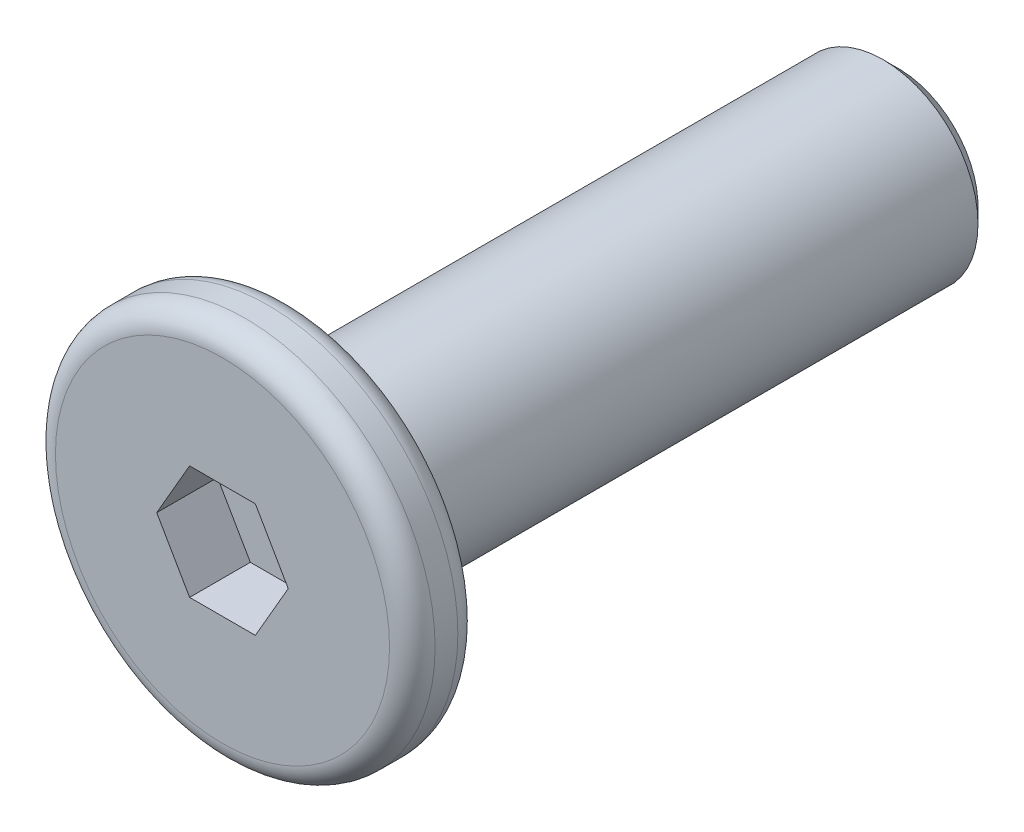
ISO-10303-21;
HEADER;
FILE_DESCRIPTION(('STEP AP214'),'2;1');
FILE_NAME('part.step','',(''),(''),'','','');
FILE_SCHEMA(('AUTOMOTIVE_DESIGN { 1 0 10303 214 1 1 1 1 }'));
ENDSEC;
DATA;
#1=APPLICATION_CONTEXT('core data for automotive mechanical design processes');
#2=APPLICATION_PROTOCOL_DEFINITION('international standard','automotive_design',2000,#1);
#3=PRODUCT_CONTEXT('',#1,'mechanical');
#4=PRODUCT('Part','Part','',(#3));
#5=PRODUCT_RELATED_PRODUCT_CATEGORY('part','',(#4));
#6=PRODUCT_DEFINITION_FORMATION('','',#4);
#7=PRODUCT_DEFINITION_CONTEXT('part definition',#1,'design');
#8=PRODUCT_DEFINITION('design','',#6,#7);
#9=PRODUCT_DEFINITION_SHAPE('','',#8);
#10=(LENGTH_UNIT() NAMED_UNIT(*) SI_UNIT(.MILLI.,.METRE.));
#11=(NAMED_UNIT(*) PLANE_ANGLE_UNIT() SI_UNIT($,.RADIAN.));
#12=(NAMED_UNIT(*) SI_UNIT($,.STERADIAN.) SOLID_ANGLE_UNIT());
#13=UNCERTAINTY_MEASURE_WITH_UNIT(LENGTH_MEASURE(1.E-05),#10,'distance_accuracy_value','');
#14=(GEOMETRIC_REPRESENTATION_CONTEXT(3) GLOBAL_UNCERTAINTY_ASSIGNED_CONTEXT((#13)) GLOBAL_UNIT_ASSIGNED_CONTEXT((#10,
#11,#12)) REPRESENTATION_CONTEXT('',''));
#15=CARTESIAN_POINT('',(0.,0.,0.));
#16=DIRECTION('',(0.,0.,1.));
#17=DIRECTION('',(1.,0.,0.));
#18=AXIS2_PLACEMENT_3D('',#15,#16,#17);
#19=CARTESIAN_POINT('',(0.,0.,0.45));
#20=DIRECTION('',(0.,0.,-1.));
#21=DIRECTION('',(-1.,0.,0.));
#22=AXIS2_PLACEMENT_3D('',#19,#20,#21);
#23=CYLINDRICAL_SURFACE('',#22,2.5);
#24=CARTESIAN_POINT('',(0.,0.,-0.15));
#25=DIRECTION('',(0.,0.,1.));
#26=DIRECTION('',(1.,0.,0.));
#27=AXIS2_PLACEMENT_3D('',#24,#25,#26);
#28=CIRCLE('',#27,2.5);
#29=CARTESIAN_POINT('',(2.5,0.,-0.15));
#30=VERTEX_POINT('',#29);
#31=EDGE_CURVE('E154',#30,#30,#28,.T.);
#32=ORIENTED_EDGE('',*,*,#31,.T.);
#33=EDGE_LOOP('',(#32));
#34=FACE_BOUND('',#33,.T.);
#35=CARTESIAN_POINT('',(0.,0.,0.15));
#36=DIRECTION('',(0.,0.,1.));
#37=DIRECTION('',(1.,0.,0.));
#38=AXIS2_PLACEMENT_3D('',#35,#36,#37);
#39=CIRCLE('',#38,2.5);
#40=CARTESIAN_POINT('',(2.5,0.,0.15));
#41=VERTEX_POINT('',#40);
#42=EDGE_CURVE('E151',#41,#41,#39,.F.);
#43=ORIENTED_EDGE('',*,*,#42,.T.);
#44=EDGE_LOOP('',(#43));
#45=FACE_BOUND('',#44,.T.);
#46=ADVANCED_FACE('F35',(#34,#45),#23,.T.);
#47=CARTESIAN_POINT('',(0.,0.,0.45));
#48=DIRECTION('',(0.,0.,1.));
#49=DIRECTION('',(1.,0.,0.));
#50=AXIS2_PLACEMENT_3D('',#47,#48,#49);
#51=PLANE('',#50);
#52=CARTESIAN_POINT('',(0.,0.,0.45));
#53=DIRECTION('',(0.,0.,1.));
#54=DIRECTION('',(1.,0.,0.));
#55=AXIS2_PLACEMENT_3D('',#52,#53,#54);
#56=CIRCLE('',#55,2.2);
#57=CARTESIAN_POINT('',(2.2,0.,0.45));
#58=VERTEX_POINT('',#57);
#59=EDGE_CURVE('E11',#58,#58,#56,.T.);
#60=ORIENTED_EDGE('',*,*,#59,.T.);
#61=EDGE_LOOP('',(#60));
#62=FACE_BOUND('',#61,.T.);
#63=DIRECTION('',(0.5,0.866025403784439,0.));
#64=VECTOR('',#63,1.);
#65=CARTESIAN_POINT('',(0.433012701892219,-0.75,0.45));
#66=LINE('',#65,#64);
#67=CARTESIAN_POINT('',(0.433012701892219,-0.75,0.45));
#68=VERTEX_POINT('',#67);
#69=CARTESIAN_POINT('',(0.866025403784439,0.,0.45));
#70=VERTEX_POINT('',#69);
#71=EDGE_CURVE('E50',#68,#70,#66,.T.);
#72=ORIENTED_EDGE('',*,*,#71,.F.);
#73=DIRECTION('',(1.,0.,0.));
#74=VECTOR('',#73,1.);
#75=CARTESIAN_POINT('',(-0.433012701892219,-0.75,0.45));
#76=LINE('',#75,#74);
#77=CARTESIAN_POINT('',(-0.433012701892219,-0.75,0.45));
#78=VERTEX_POINT('',#77);
#79=EDGE_CURVE('E133',#78,#68,#76,.T.);
#80=ORIENTED_EDGE('',*,*,#79,.F.);
#81=DIRECTION('',(0.500000000000001,-0.866025403784438,0.));
#82=VECTOR('',#81,1.);
#83=CARTESIAN_POINT('',(-0.866025403784439,0.,0.45));
#84=LINE('',#83,#82);
#85=CARTESIAN_POINT('',(-0.866025403784439,0.,0.45));
#86=VERTEX_POINT('',#85);
#87=EDGE_CURVE('E131',#86,#78,#84,.T.);
#88=ORIENTED_EDGE('',*,*,#87,.F.);
#89=DIRECTION('',(-0.5,-0.866025403784438,0.));
#90=VECTOR('',#89,1.);
#91=CARTESIAN_POINT('',(-0.433012701892219,0.75,0.45));
#92=LINE('',#91,#90);
#93=CARTESIAN_POINT('',(-0.433012701892219,0.75,0.45));
#94=VERTEX_POINT('',#93);
#95=EDGE_CURVE('E98',#94,#86,#92,.T.);
#96=ORIENTED_EDGE('',*,*,#95,.F.);
#97=DIRECTION('',(-1.,0.,0.));
#98=VECTOR('',#97,1.);
#99=CARTESIAN_POINT('',(0.433012701892219,0.75,0.45));
#100=LINE('',#99,#98);
#101=CARTESIAN_POINT('',(0.433012701892219,0.75,0.45));
#102=VERTEX_POINT('',#101);
#103=EDGE_CURVE('E127',#102,#94,#100,.T.);
#104=ORIENTED_EDGE('',*,*,#103,.F.);
#105=DIRECTION('',(-0.5,0.866025403784438,0.));
#106=VECTOR('',#105,1.);
#107=CARTESIAN_POINT('',(0.866025403784439,0.,0.45));
#108=LINE('',#107,#106);
#109=EDGE_CURVE('E124',#70,#102,#108,.T.);
#110=ORIENTED_EDGE('',*,*,#109,.F.);
#111=EDGE_LOOP('',(#72,#80,#88,#96,#104,#110));
#112=FACE_BOUND('',#111,.T.);
#113=ADVANCED_FACE('F169',(#62,#112),#51,.T.);
#114=CARTESIAN_POINT('',(0.,0.,-0.45));
#115=DIRECTION('',(0.,0.,1.));
#116=DIRECTION('',(1.,0.,0.));
#117=AXIS2_PLACEMENT_3D('',#114,#115,#116);
#118=PLANE('',#117);
#119=CARTESIAN_POINT('',(0.,0.,-0.45));
#120=DIRECTION('',(0.,0.,1.));
#121=DIRECTION('',(1.,0.,0.));
#122=AXIS2_PLACEMENT_3D('',#119,#120,#121);
#123=CIRCLE('',#122,2.2);
#124=CARTESIAN_POINT('',(2.2,0.,-0.45));
#125=VERTEX_POINT('',#124);
#126=EDGE_CURVE('E43',#125,#125,#123,.F.);
#127=ORIENTED_EDGE('',*,*,#126,.T.);
#128=EDGE_LOOP('',(#127));
#129=FACE_BOUND('',#128,.T.);
#130=CARTESIAN_POINT('',(0.,0.,-0.45));
#131=DIRECTION('',(0.,0.,-1.));
#132=DIRECTION('',(-1.,0.,0.));
#133=AXIS2_PLACEMENT_3D('',#130,#131,#132);
#134=CIRCLE('',#133,1.25);
#135=CARTESIAN_POINT('',(-1.25,0.,-0.45));
#136=VERTEX_POINT('',#135);
#137=EDGE_CURVE('E137',#136,#136,#134,.T.);
#138=ORIENTED_EDGE('',*,*,#137,.F.);
#139=EDGE_LOOP('',(#138));
#140=FACE_BOUND('',#139,.T.);
#141=ADVANCED_FACE('F159',(#129,#140),#118,.F.);
#142=CARTESIAN_POINT('',(0.,0.,-8.45));
#143=DIRECTION('',(0.,0.,1.));
#144=DIRECTION('',(1.,0.,0.));
#145=AXIS2_PLACEMENT_3D('',#142,#143,#144);
#146=CYLINDRICAL_SURFACE('',#145,1.25);
#147=CARTESIAN_POINT('',(0.,0.,-8.25));
#148=DIRECTION('',(0.,0.,-1.));
#149=DIRECTION('',(-1.,0.,0.));
#150=AXIS2_PLACEMENT_3D('',#147,#148,#149);
#151=CIRCLE('',#150,1.25);
#152=CARTESIAN_POINT('',(-1.25,0.,-8.25));
#153=VERTEX_POINT('',#152);
#154=EDGE_CURVE('E148',#153,#153,#151,.F.);
#155=ORIENTED_EDGE('',*,*,#154,.T.);
#156=EDGE_LOOP('',(#155));
#157=FACE_BOUND('',#156,.T.);
#158=ORIENTED_EDGE('',*,*,#137,.T.);
#159=EDGE_LOOP('',(#158));
#160=FACE_BOUND('',#159,.T.);
#161=ADVANCED_FACE('F204',(#157,#160),#146,.T.);
#162=CARTESIAN_POINT('',(0.,0.,-8.45));
#163=DIRECTION('',(0.,0.,-1.));
#164=DIRECTION('',(-1.,0.,0.));
#165=AXIS2_PLACEMENT_3D('',#162,#163,#164);
#166=PLANE('',#165);
#167=CARTESIAN_POINT('',(0.,0.,-8.45));
#168=DIRECTION('',(0.,0.,-1.));
#169=DIRECTION('',(-1.,0.,0.));
#170=AXIS2_PLACEMENT_3D('',#167,#168,#169);
#171=CIRCLE('',#170,1.05);
#172=CARTESIAN_POINT('',(-1.05,0.,-8.45));
#173=VERTEX_POINT('',#172);
#174=EDGE_CURVE('E145',#173,#173,#171,.T.);
#175=ORIENTED_EDGE('',*,*,#174,.T.);
#176=EDGE_LOOP('',(#175));
#177=FACE_BOUND('',#176,.T.);
#178=ADVANCED_FACE('F196',(#177),#166,.T.);
#179=CARTESIAN_POINT('',(0.,0.,-8.45));
#180=DIRECTION('',(0.,0.,1.));
#181=DIRECTION('',(1.,0.,0.));
#182=AXIS2_PLACEMENT_3D('',#179,#180,#181);
#183=CONICAL_SURFACE('',#182,1.05,0.785398163397446);
#184=ORIENTED_EDGE('',*,*,#154,.F.);
#185=EDGE_LOOP('',(#184));
#186=FACE_BOUND('',#185,.T.);
#187=ORIENTED_EDGE('',*,*,#174,.F.);
#188=EDGE_LOOP('',(#187));
#189=FACE_BOUND('',#188,.T.);
#190=ADVANCED_FACE('F189',(#186,#189),#183,.T.);
#191=CARTESIAN_POINT('',(0.433012701892219,-0.75,-0.35));
#192=DIRECTION('',(0.866025403784439,-0.5,0.));
#193=DIRECTION('',(0.5,0.866025403784439,0.));
#194=AXIS2_PLACEMENT_3D('',#191,#192,#193);
#195=PLANE('',#194);
#196=ORIENTED_EDGE('',*,*,#71,.T.);
#197=DIRECTION('',(0.,0.,1.));
#198=VECTOR('',#197,1.);
#199=CARTESIAN_POINT('',(0.866025403784439,0.,-0.35));
#200=LINE('',#199,#198);
#201=CARTESIAN_POINT('',(0.866025403784439,0.,-0.35));
#202=VERTEX_POINT('',#201);
#203=EDGE_CURVE('E80',#202,#70,#200,.T.);
#204=ORIENTED_EDGE('',*,*,#203,.F.);
#205=DIRECTION('',(0.5,0.866025403784439,0.));
#206=VECTOR('',#205,1.);
#207=CARTESIAN_POINT('',(0.433012701892219,-0.75,-0.35));
#208=LINE('',#207,#206);
#209=CARTESIAN_POINT('',(0.433012701892219,-0.75,-0.35));
#210=VERTEX_POINT('',#209);
#211=EDGE_CURVE('E135',#210,#202,#208,.T.);
#212=ORIENTED_EDGE('',*,*,#211,.F.);
#213=DIRECTION('',(0.,0.,1.));
#214=VECTOR('',#213,1.);
#215=CARTESIAN_POINT('',(0.433012701892219,-0.75,-0.35));
#216=LINE('',#215,#214);
#217=EDGE_CURVE('E58',#210,#68,#216,.T.);
#218=ORIENTED_EDGE('',*,*,#217,.T.);
#219=EDGE_LOOP('',(#196,#204,#212,#218));
#220=FACE_BOUND('',#219,.T.);
#221=ADVANCED_FACE('F186',(#220),#195,.F.);
#222=CARTESIAN_POINT('',(-0.433012701892219,-0.75,-0.35));
#223=DIRECTION('',(0.,-1.,0.));
#224=DIRECTION('',(0.,0.,-1.));
#225=AXIS2_PLACEMENT_3D('',#222,#223,#224);
#226=PLANE('',#225);
#227=ORIENTED_EDGE('',*,*,#79,.T.);
#228=ORIENTED_EDGE('',*,*,#217,.F.);
#229=DIRECTION('',(1.,0.,0.));
#230=VECTOR('',#229,1.);
#231=CARTESIAN_POINT('',(-0.433012701892219,-0.75,-0.35));
#232=LINE('',#231,#230);
#233=CARTESIAN_POINT('',(-0.433012701892219,-0.75,-0.35));
#234=VERTEX_POINT('',#233);
#235=EDGE_CURVE('E110',#234,#210,#232,.T.);
#236=ORIENTED_EDGE('',*,*,#235,.F.);
#237=DIRECTION('',(0.,0.,1.));
#238=VECTOR('',#237,1.);
#239=CARTESIAN_POINT('',(-0.433012701892219,-0.75,-0.35));
#240=LINE('',#239,#238);
#241=EDGE_CURVE('E102',#234,#78,#240,.T.);
#242=ORIENTED_EDGE('',*,*,#241,.T.);
#243=EDGE_LOOP('',(#227,#228,#236,#242));
#244=FACE_BOUND('',#243,.T.);
#245=ADVANCED_FACE('F188',(#244),#226,.F.);
#246=CARTESIAN_POINT('',(-0.866025403784439,0.,-0.35));
#247=DIRECTION('',(-0.866025403784438,-0.5,0.));
#248=DIRECTION('',(0.5,-0.866025403784438,0.));
#249=AXIS2_PLACEMENT_3D('',#246,#247,#248);
#250=PLANE('',#249);
#251=ORIENTED_EDGE('',*,*,#87,.T.);
#252=ORIENTED_EDGE('',*,*,#241,.F.);
#253=DIRECTION('',(0.500000000000001,-0.866025403784438,0.));
#254=VECTOR('',#253,1.);
#255=CARTESIAN_POINT('',(-0.866025403784439,0.,-0.35));
#256=LINE('',#255,#254);
#257=CARTESIAN_POINT('',(-0.866025403784439,0.,-0.35));
#258=VERTEX_POINT('',#257);
#259=EDGE_CURVE('E106',#258,#234,#256,.T.);
#260=ORIENTED_EDGE('',*,*,#259,.F.);
#261=DIRECTION('',(0.,0.,1.));
#262=VECTOR('',#261,1.);
#263=CARTESIAN_POINT('',(-0.866025403784439,0.,-0.35));
#264=LINE('',#263,#262);
#265=EDGE_CURVE('E91',#258,#86,#264,.T.);
#266=ORIENTED_EDGE('',*,*,#265,.T.);
#267=EDGE_LOOP('',(#251,#252,#260,#266));
#268=FACE_BOUND('',#267,.T.);
#269=ADVANCED_FACE('F107',(#268),#250,.F.);
#270=CARTESIAN_POINT('',(-0.433012701892219,0.75,-0.35));
#271=DIRECTION('',(-0.866025403784438,0.5,0.));
#272=DIRECTION('',(-0.5,-0.866025403784439,0.));
#273=AXIS2_PLACEMENT_3D('',#270,#271,#272);
#274=PLANE('',#273);
#275=ORIENTED_EDGE('',*,*,#95,.T.);
#276=ORIENTED_EDGE('',*,*,#265,.F.);
#277=DIRECTION('',(-0.5,-0.866025403784438,0.));
#278=VECTOR('',#277,1.);
#279=CARTESIAN_POINT('',(-0.433012701892219,0.75,-0.35));
#280=LINE('',#279,#278);
#281=CARTESIAN_POINT('',(-0.433012701892219,0.75,-0.35));
#282=VERTEX_POINT('',#281);
#283=EDGE_CURVE('E95',#282,#258,#280,.T.);
#284=ORIENTED_EDGE('',*,*,#283,.F.);
#285=DIRECTION('',(0.,0.,1.));
#286=VECTOR('',#285,1.);
#287=CARTESIAN_POINT('',(-0.433012701892219,0.75,-0.35));
#288=LINE('',#287,#286);
#289=EDGE_CURVE('E103',#282,#94,#288,.T.);
#290=ORIENTED_EDGE('',*,*,#289,.T.);
#291=EDGE_LOOP('',(#275,#276,#284,#290));
#292=FACE_BOUND('',#291,.T.);
#293=ADVANCED_FACE('F93',(#292),#274,.F.);
#294=CARTESIAN_POINT('',(0.433012701892219,0.75,-0.35));
#295=DIRECTION('',(0.,1.,0.));
#296=DIRECTION('',(-1.,0.,0.));
#297=AXIS2_PLACEMENT_3D('',#294,#295,#296);
#298=PLANE('',#297);
#299=ORIENTED_EDGE('',*,*,#103,.T.);
#300=ORIENTED_EDGE('',*,*,#289,.F.);
#301=DIRECTION('',(-1.,0.,0.));
#302=VECTOR('',#301,1.);
#303=CARTESIAN_POINT('',(0.433012701892219,0.75,-0.35));
#304=LINE('',#303,#302);
#305=CARTESIAN_POINT('',(0.433012701892219,0.75,-0.35));
#306=VERTEX_POINT('',#305);
#307=EDGE_CURVE('E116',#306,#282,#304,.T.);
#308=ORIENTED_EDGE('',*,*,#307,.F.);
#309=DIRECTION('',(0.,0.,1.));
#310=VECTOR('',#309,1.);
#311=CARTESIAN_POINT('',(0.433012701892219,0.75,-0.35));
#312=LINE('',#311,#310);
#313=EDGE_CURVE('E140',#306,#102,#312,.T.);
#314=ORIENTED_EDGE('',*,*,#313,.T.);
#315=EDGE_LOOP('',(#299,#300,#308,#314));
#316=FACE_BOUND('',#315,.T.);
#317=ADVANCED_FACE('F257',(#316),#298,.F.);
#318=CARTESIAN_POINT('',(0.866025403784439,0.,-0.35));
#319=DIRECTION('',(0.866025403784438,0.5,0.));
#320=DIRECTION('',(-0.5,0.866025403784438,0.));
#321=AXIS2_PLACEMENT_3D('',#318,#319,#320);
#322=PLANE('',#321);
#323=ORIENTED_EDGE('',*,*,#109,.T.);
#324=ORIENTED_EDGE('',*,*,#313,.F.);
#325=DIRECTION('',(-0.5,0.866025403784438,0.));
#326=VECTOR('',#325,1.);
#327=CARTESIAN_POINT('',(0.866025403784439,0.,-0.35));
#328=LINE('',#327,#326);
#329=EDGE_CURVE('E118',#202,#306,#328,.T.);
#330=ORIENTED_EDGE('',*,*,#329,.F.);
#331=ORIENTED_EDGE('',*,*,#203,.T.);
#332=EDGE_LOOP('',(#323,#324,#330,#331));
#333=FACE_BOUND('',#332,.T.);
#334=ADVANCED_FACE('F184',(#333),#322,.F.);
#335=CARTESIAN_POINT('',(0.,0.,-0.35));
#336=DIRECTION('',(0.,0.,1.));
#337=DIRECTION('',(1.,0.,0.));
#338=AXIS2_PLACEMENT_3D('',#335,#336,#337);
#339=PLANE('',#338);
#340=ORIENTED_EDGE('',*,*,#211,.T.);
#341=ORIENTED_EDGE('',*,*,#329,.T.);
#342=ORIENTED_EDGE('',*,*,#307,.T.);
#343=ORIENTED_EDGE('',*,*,#283,.T.);
#344=ORIENTED_EDGE('',*,*,#259,.T.);
#345=ORIENTED_EDGE('',*,*,#235,.T.);
#346=EDGE_LOOP('',(#340,#341,#342,#343,#344,#345));
#347=FACE_BOUND('',#346,.T.);
#348=ADVANCED_FACE('F113',(#347),#339,.T.);
#349=CARTESIAN_POINT('',(0.,0.,-0.15));
#350=DIRECTION('',(0.,0.,1.));
#351=DIRECTION('',(1.,0.,0.));
#352=AXIS2_PLACEMENT_3D('',#349,#350,#351);
#353=TOROIDAL_SURFACE('',#352,2.2,0.3);
#354=ORIENTED_EDGE('',*,*,#126,.F.);
#355=EDGE_LOOP('',(#354));
#356=FACE_BOUND('',#355,.T.);
#357=ORIENTED_EDGE('',*,*,#31,.F.);
#358=EDGE_LOOP('',(#357));
#359=FACE_BOUND('',#358,.T.);
#360=ADVANCED_FACE('F162',(#356,#359),#353,.T.);
#361=CARTESIAN_POINT('',(0.,0.,0.15));
#362=DIRECTION('',(0.,0.,1.));
#363=DIRECTION('',(1.,0.,0.));
#364=AXIS2_PLACEMENT_3D('',#361,#362,#363);
#365=TOROIDAL_SURFACE('',#364,2.2,0.3);
#366=ORIENTED_EDGE('',*,*,#42,.F.);
#367=EDGE_LOOP('',(#366));
#368=FACE_BOUND('',#367,.T.);
#369=ORIENTED_EDGE('',*,*,#59,.F.);
#370=EDGE_LOOP('',(#369));
#371=FACE_BOUND('',#370,.T.);
#372=ADVANCED_FACE('F37',(#368,#371),#365,.T.);
#373=CLOSED_SHELL('',(#46,#113,#141,#161,#178,#190,#221,#245,#269,#293,#317,#334,#348,#360,#372));
#374=MANIFOLD_SOLID_BREP('B2',#373);
#375=ADVANCED_BREP_SHAPE_REPRESENTATION('',(#18,#374),#14);
#376=SHAPE_DEFINITION_REPRESENTATION(#9,#375);
ENDSEC;
END-ISO-10303-21;
